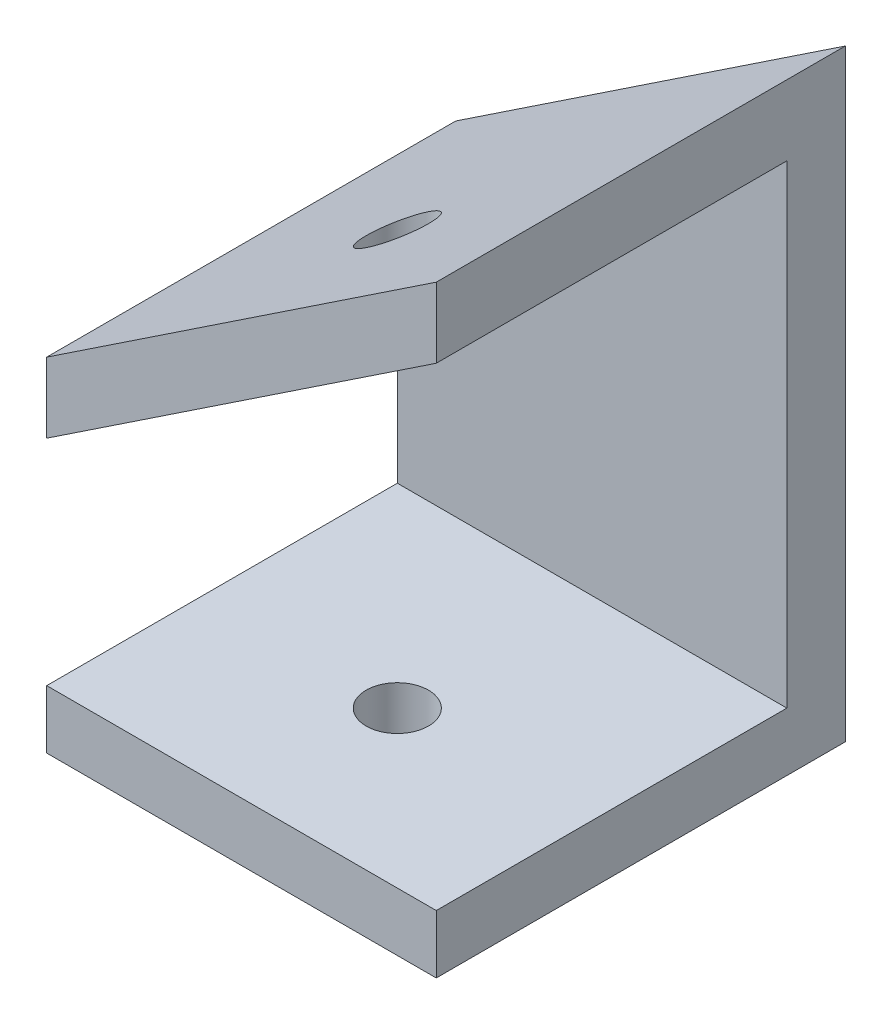
ISO-10303-21;
HEADER;
FILE_DESCRIPTION(('STEP AP214'),'2;1');
FILE_NAME('part.step','',(''),(''),'','','');
FILE_SCHEMA(('AUTOMOTIVE_DESIGN { 1 0 10303 214 1 1 1 1 }'));
ENDSEC;
DATA;
#1=APPLICATION_CONTEXT('core data for automotive mechanical design processes');
#2=APPLICATION_PROTOCOL_DEFINITION('international standard','automotive_design',2000,#1);
#3=PRODUCT_CONTEXT('',#1,'mechanical');
#4=PRODUCT('Part','Part','',(#3));
#5=PRODUCT_RELATED_PRODUCT_CATEGORY('part','',(#4));
#6=PRODUCT_DEFINITION_FORMATION('','',#4);
#7=PRODUCT_DEFINITION_CONTEXT('part definition',#1,'design');
#8=PRODUCT_DEFINITION('design','',#6,#7);
#9=PRODUCT_DEFINITION_SHAPE('','',#8);
#10=(LENGTH_UNIT() NAMED_UNIT(*) SI_UNIT(.MILLI.,.METRE.));
#11=(NAMED_UNIT(*) PLANE_ANGLE_UNIT() SI_UNIT($,.RADIAN.));
#12=(NAMED_UNIT(*) SI_UNIT($,.STERADIAN.) SOLID_ANGLE_UNIT());
#13=UNCERTAINTY_MEASURE_WITH_UNIT(LENGTH_MEASURE(1.E-05),#10,'distance_accuracy_value','');
#14=(GEOMETRIC_REPRESENTATION_CONTEXT(3) GLOBAL_UNCERTAINTY_ASSIGNED_CONTEXT((#13)) GLOBAL_UNIT_ASSIGNED_CONTEXT((#10,
#11,#12)) REPRESENTATION_CONTEXT('',''));
#15=CARTESIAN_POINT('',(0.,0.,0.));
#16=DIRECTION('',(0.,0.,1.));
#17=DIRECTION('',(1.,0.,0.));
#18=AXIS2_PLACEMENT_3D('',#15,#16,#17);
#19=CARTESIAN_POINT('',(12.3656729594458,-5.90614159277213,3.));
#20=DIRECTION('',(0.,1.,0.));
#21=DIRECTION('',(-1.,0.,0.));
#22=AXIS2_PLACEMENT_3D('',#19,#20,#21);
#23=PLANE('',#22);
#24=CARTESIAN_POINT('',(2.36567295944577,-5.90614159277213,13.));
#25=DIRECTION('',(0.,-1.,0.));
#26=DIRECTION('',(1.,0.,0.));
#27=AXIS2_PLACEMENT_3D('',#24,#25,#26);
#28=CIRCLE('',#27,1.6);
#29=CARTESIAN_POINT('',(3.96567295944577,-5.90614159277213,13.));
#30=VERTEX_POINT('',#29);
#31=EDGE_CURVE('E152',#30,#30,#28,.T.);
#32=ORIENTED_EDGE('',*,*,#31,.F.);
#33=EDGE_LOOP('',(#32));
#34=FACE_BOUND('',#33,.T.);
#35=DIRECTION('',(1.,0.,0.));
#36=VECTOR('',#35,1.);
#37=CARTESIAN_POINT('',(12.3656729594458,-5.90614159277213,0.));
#38=LINE('',#37,#36);
#39=CARTESIAN_POINT('',(-7.63432704055423,-5.90614159277213,0.));
#40=VERTEX_POINT('',#39);
#41=CARTESIAN_POINT('',(12.3656729594458,-5.90614159277213,0.));
#42=VERTEX_POINT('',#41);
#43=EDGE_CURVE('E71',#40,#42,#38,.T.);
#44=ORIENTED_EDGE('',*,*,#43,.T.);
#45=DIRECTION('',(0.,0.,-1.));
#46=VECTOR('',#45,1.);
#47=CARTESIAN_POINT('',(12.3656729594458,-5.90614159277213,3.));
#48=LINE('',#47,#46);
#49=CARTESIAN_POINT('',(12.3656729594458,-5.90614159277213,21.));
#50=VERTEX_POINT('',#49);
#51=EDGE_CURVE('E45',#50,#42,#48,.T.);
#52=ORIENTED_EDGE('',*,*,#51,.F.);
#53=DIRECTION('',(1.,0.,0.));
#54=VECTOR('',#53,1.);
#55=CARTESIAN_POINT('',(12.3656729594458,-5.90614159277213,21.));
#56=LINE('',#55,#54);
#57=CARTESIAN_POINT('',(-7.63432704055423,-5.90614159277213,21.));
#58=VERTEX_POINT('',#57);
#59=EDGE_CURVE('E132',#58,#50,#56,.T.);
#60=ORIENTED_EDGE('',*,*,#59,.F.);
#61=DIRECTION('',(0.,0.,-1.));
#62=VECTOR('',#61,1.);
#63=CARTESIAN_POINT('',(-7.63432704055423,-5.90614159277213,3.));
#64=LINE('',#63,#62);
#65=EDGE_CURVE('E11',#58,#40,#64,.T.);
#66=ORIENTED_EDGE('',*,*,#65,.T.);
#67=EDGE_LOOP('',(#44,#52,#60,#66));
#68=FACE_BOUND('',#67,.T.);
#69=ADVANCED_FACE('F37',(#34,#68),#23,.F.);
#70=CARTESIAN_POINT('',(12.3656729594458,21.4271917405612,3.));
#71=DIRECTION('',(-1.,0.,0.));
#72=DIRECTION('',(0.,-1.,0.));
#73=AXIS2_PLACEMENT_3D('',#70,#71,#72);
#74=PLANE('',#73);
#75=DIRECTION('',(0.,1.,0.));
#76=VECTOR('',#75,1.);
#77=CARTESIAN_POINT('',(12.3656729594458,21.4271917405612,3.));
#78=LINE('',#77,#76);
#79=CARTESIAN_POINT('',(12.3656729594458,-2.90614159277213,3.));
#80=VERTEX_POINT('',#79);
#81=CARTESIAN_POINT('',(12.3656729594458,21.4271917405612,3.));
#82=VERTEX_POINT('',#81);
#83=EDGE_CURVE('E105',#80,#82,#78,.T.);
#84=ORIENTED_EDGE('',*,*,#83,.F.);
#85=DIRECTION('',(0.,0.,1.));
#86=VECTOR('',#85,1.);
#87=CARTESIAN_POINT('',(12.3656729594458,-2.90614159277213,0.));
#88=LINE('',#87,#86);
#89=CARTESIAN_POINT('',(12.3656729594458,-2.90614159277213,21.));
#90=VERTEX_POINT('',#89);
#91=EDGE_CURVE('E141',#80,#90,#88,.T.);
#92=ORIENTED_EDGE('',*,*,#91,.T.);
#93=DIRECTION('',(0.,1.,0.));
#94=VECTOR('',#93,1.);
#95=CARTESIAN_POINT('',(12.3656729594458,-2.90614159277213,21.));
#96=LINE('',#95,#94);
#97=EDGE_CURVE('E92',#50,#90,#96,.T.);
#98=ORIENTED_EDGE('',*,*,#97,.F.);
#99=ORIENTED_EDGE('',*,*,#51,.T.);
#100=DIRECTION('',(0.,1.,0.));
#101=VECTOR('',#100,1.);
#102=CARTESIAN_POINT('',(12.3656729594458,21.4271917405612,0.));
#103=LINE('',#102,#101);
#104=CARTESIAN_POINT('',(12.3656729594458,25.0327430160252,0.));
#105=VERTEX_POINT('',#104);
#106=EDGE_CURVE('E80',#42,#105,#103,.T.);
#107=ORIENTED_EDGE('',*,*,#106,.T.);
#108=DIRECTION('',(0.,0.,1.));
#109=VECTOR('',#108,1.);
#110=CARTESIAN_POINT('',(12.3656729594458,25.0327430160252,0.));
#111=LINE('',#110,#109);
#112=CARTESIAN_POINT('',(12.3656729594458,25.0327430160252,21.));
#113=VERTEX_POINT('',#112);
#114=EDGE_CURVE('E113',#105,#113,#111,.T.);
#115=ORIENTED_EDGE('',*,*,#114,.T.);
#116=DIRECTION('',(0.,1.,0.));
#117=VECTOR('',#116,1.);
#118=CARTESIAN_POINT('',(12.3656729594458,21.4271917405612,21.));
#119=LINE('',#118,#117);
#120=CARTESIAN_POINT('',(12.3656729594458,21.4271917405612,21.));
#121=VERTEX_POINT('',#120);
#122=EDGE_CURVE('E121',#121,#113,#119,.T.);
#123=ORIENTED_EDGE('',*,*,#122,.F.);
#124=DIRECTION('',(0.,0.,1.));
#125=VECTOR('',#124,1.);
#126=CARTESIAN_POINT('',(12.3656729594458,21.4271917405612,0.));
#127=LINE('',#126,#125);
#128=EDGE_CURVE('E110',#82,#121,#127,.T.);
#129=ORIENTED_EDGE('',*,*,#128,.F.);
#130=EDGE_LOOP('',(#84,#92,#98,#99,#107,#115,#123,#129));
#131=FACE_BOUND('',#130,.T.);
#132=ADVANCED_FACE('F86',(#131),#74,.F.);
#133=CARTESIAN_POINT('',(-7.63432704055423,-2.90614159277213,3.));
#134=DIRECTION('',(1.,0.,0.));
#135=DIRECTION('',(0.,0.,-1.));
#136=AXIS2_PLACEMENT_3D('',#133,#134,#135);
#137=PLANE('',#136);
#138=DIRECTION('',(0.,-1.,0.));
#139=VECTOR('',#138,1.);
#140=CARTESIAN_POINT('',(-7.63432704055423,-2.90614159277213,0.));
#141=LINE('',#140,#139);
#142=CARTESIAN_POINT('',(-7.63432704055423,11.6994096826919,0.));
#143=VERTEX_POINT('',#142);
#144=EDGE_CURVE('E100',#143,#40,#141,.T.);
#145=ORIENTED_EDGE('',*,*,#144,.T.);
#146=ORIENTED_EDGE('',*,*,#65,.F.);
#147=DIRECTION('',(0.,-1.,0.));
#148=VECTOR('',#147,1.);
#149=CARTESIAN_POINT('',(-7.63432704055423,-5.90614159277213,21.));
#150=LINE('',#149,#148);
#151=CARTESIAN_POINT('',(-7.63432704055423,-2.90614159277213,21.));
#152=VERTEX_POINT('',#151);
#153=EDGE_CURVE('E138',#152,#58,#150,.T.);
#154=ORIENTED_EDGE('',*,*,#153,.F.);
#155=DIRECTION('',(0.,0.,1.));
#156=VECTOR('',#155,1.);
#157=CARTESIAN_POINT('',(-7.63432704055423,-2.90614159277213,0.));
#158=LINE('',#157,#156);
#159=CARTESIAN_POINT('',(-7.63432704055423,-2.90614159277213,3.));
#160=VERTEX_POINT('',#159);
#161=EDGE_CURVE('E142',#160,#152,#158,.T.);
#162=ORIENTED_EDGE('',*,*,#161,.F.);
#163=DIRECTION('',(0.,-1.,0.));
#164=VECTOR('',#163,1.);
#165=CARTESIAN_POINT('',(-7.63432704055423,-2.90614159277213,3.));
#166=LINE('',#165,#164);
#167=CARTESIAN_POINT('',(-7.63432704055423,8.09385840722787,3.));
#168=VERTEX_POINT('',#167);
#169=EDGE_CURVE('E52',#168,#160,#166,.T.);
#170=ORIENTED_EDGE('',*,*,#169,.F.);
#171=DIRECTION('',(0.,0.,1.));
#172=VECTOR('',#171,1.);
#173=CARTESIAN_POINT('',(-7.63432704055423,8.09385840722787,0.));
#174=LINE('',#173,#172);
#175=CARTESIAN_POINT('',(-7.63432704055423,8.09385840722787,21.));
#176=VERTEX_POINT('',#175);
#177=EDGE_CURVE('E108',#168,#176,#174,.T.);
#178=ORIENTED_EDGE('',*,*,#177,.T.);
#179=DIRECTION('',(0.,-1.,0.));
#180=VECTOR('',#179,1.);
#181=CARTESIAN_POINT('',(-7.63432704055423,8.09385840722787,21.));
#182=LINE('',#181,#180);
#183=CARTESIAN_POINT('',(-7.63432704055423,11.6994096826919,21.));
#184=VERTEX_POINT('',#183);
#185=EDGE_CURVE('E127',#184,#176,#182,.T.);
#186=ORIENTED_EDGE('',*,*,#185,.F.);
#187=DIRECTION('',(0.,0.,1.));
#188=VECTOR('',#187,1.);
#189=CARTESIAN_POINT('',(-7.63432704055423,11.6994096826919,0.));
#190=LINE('',#189,#188);
#191=EDGE_CURVE('E81',#143,#184,#190,.T.);
#192=ORIENTED_EDGE('',*,*,#191,.F.);
#193=EDGE_LOOP('',(#145,#146,#154,#162,#170,#178,#186,#192));
#194=FACE_BOUND('',#193,.T.);
#195=ADVANCED_FACE('F172',(#194),#137,.F.);
#196=CARTESIAN_POINT('',(0.,0.,3.));
#197=DIRECTION('',(0.,0.,-1.));
#198=DIRECTION('',(-1.,0.,0.));
#199=AXIS2_PLACEMENT_3D('',#196,#197,#198);
#200=PLANE('',#199);
#201=ORIENTED_EDGE('',*,*,#169,.T.);
#202=DIRECTION('',(1.,0.,0.));
#203=VECTOR('',#202,1.);
#204=CARTESIAN_POINT('',(0.,-2.90614159277213,3.));
#205=LINE('',#204,#203);
#206=EDGE_CURVE('E130',#160,#80,#205,.T.);
#207=ORIENTED_EDGE('',*,*,#206,.T.);
#208=ORIENTED_EDGE('',*,*,#83,.T.);
#209=DIRECTION('',(-0.832050294337843,-0.554700196225229,0.));
#210=VECTOR('',#209,1.);
#211=CARTESIAN_POINT('',(-7.63432704055423,8.09385840722787,3.));
#212=LINE('',#211,#210);
#213=EDGE_CURVE('E94',#82,#168,#212,.T.);
#214=ORIENTED_EDGE('',*,*,#213,.T.);
#215=EDGE_LOOP('',(#201,#207,#208,#214));
#216=FACE_BOUND('',#215,.T.);
#217=ADVANCED_FACE('F203',(#216),#200,.F.);
#218=CARTESIAN_POINT('',(0.,0.,0.));
#219=DIRECTION('',(0.,0.,-1.));
#220=DIRECTION('',(-1.,0.,0.));
#221=AXIS2_PLACEMENT_3D('',#218,#219,#220);
#222=PLANE('',#221);
#223=DIRECTION('',(-0.832050294337844,-0.554700196225229,0.));
#224=VECTOR('',#223,1.);
#225=CARTESIAN_POINT('',(-7.63432704055423,11.6994096826919,0.));
#226=LINE('',#225,#224);
#227=EDGE_CURVE('E99',#105,#143,#226,.T.);
#228=ORIENTED_EDGE('',*,*,#227,.F.);
#229=ORIENTED_EDGE('',*,*,#106,.F.);
#230=ORIENTED_EDGE('',*,*,#43,.F.);
#231=ORIENTED_EDGE('',*,*,#144,.F.);
#232=EDGE_LOOP('',(#228,#229,#230,#231));
#233=FACE_BOUND('',#232,.T.);
#234=ADVANCED_FACE('F97',(#233),#222,.T.);
#235=CARTESIAN_POINT('',(-7.63432704055423,8.09385840722787,0.));
#236=DIRECTION('',(0.554700196225229,-0.832050294337844,0.));
#237=DIRECTION('',(0.832050294337844,0.554700196225229,0.));
#238=AXIS2_PLACEMENT_3D('',#235,#236,#237);
#239=PLANE('',#238);
#240=CARTESIAN_POINT('',(2.36567295944577,14.7605250738945,13.));
#241=DIRECTION('',(0.554700196225229,-0.832050294337844,0.));
#242=DIRECTION('',(-0.832050294337844,-0.554700196225229,0.));
#243=AXIS2_PLACEMENT_3D('',#240,#241,#242);
#244=ELLIPSE('',#243,1.92296068024746,1.6);
#245=CARTESIAN_POINT('',(0.765672959445768,13.6938584072279,13.));
#246=VERTEX_POINT('',#245);
#247=EDGE_CURVE('E145',#246,#246,#244,.T.);
#248=ORIENTED_EDGE('',*,*,#247,.F.);
#249=EDGE_LOOP('',(#248));
#250=FACE_BOUND('',#249,.T.);
#251=ORIENTED_EDGE('',*,*,#213,.F.);
#252=ORIENTED_EDGE('',*,*,#128,.T.);
#253=DIRECTION('',(0.832050294337843,0.554700196225229,0.));
#254=VECTOR('',#253,1.);
#255=CARTESIAN_POINT('',(-7.63432704055423,8.09385840722787,21.));
#256=LINE('',#255,#254);
#257=EDGE_CURVE('E124',#176,#121,#256,.T.);
#258=ORIENTED_EDGE('',*,*,#257,.F.);
#259=ORIENTED_EDGE('',*,*,#177,.F.);
#260=EDGE_LOOP('',(#251,#252,#258,#259));
#261=FACE_BOUND('',#260,.T.);
#262=ADVANCED_FACE('F202',(#250,#261),#239,.T.);
#263=CARTESIAN_POINT('',(-7.63432704055423,11.6994096826919,0.));
#264=DIRECTION('',(-0.554700196225229,0.832050294337844,0.));
#265=DIRECTION('',(-0.832050294337844,-0.554700196225229,0.));
#266=AXIS2_PLACEMENT_3D('',#263,#264,#265);
#267=PLANE('',#266);
#268=CARTESIAN_POINT('',(2.36567295944577,18.3660763493585,13.));
#269=DIRECTION('',(-0.554700196225229,0.832050294337844,0.));
#270=DIRECTION('',(-0.832050294337844,-0.554700196225229,0.));
#271=AXIS2_PLACEMENT_3D('',#268,#269,#270);
#272=ELLIPSE('',#271,1.92296068024746,1.6);
#273=CARTESIAN_POINT('',(0.765672959445768,17.2994096826919,13.));
#274=VERTEX_POINT('',#273);
#275=EDGE_CURVE('E149',#274,#274,#272,.T.);
#276=ORIENTED_EDGE('',*,*,#275,.F.);
#277=EDGE_LOOP('',(#276));
#278=FACE_BOUND('',#277,.T.);
#279=ORIENTED_EDGE('',*,*,#191,.T.);
#280=DIRECTION('',(-0.832050294337844,-0.554700196225229,0.));
#281=VECTOR('',#280,1.);
#282=CARTESIAN_POINT('',(-7.63432704055423,11.6994096826919,21.));
#283=LINE('',#282,#281);
#284=EDGE_CURVE('E118',#113,#184,#283,.T.);
#285=ORIENTED_EDGE('',*,*,#284,.F.);
#286=ORIENTED_EDGE('',*,*,#114,.F.);
#287=ORIENTED_EDGE('',*,*,#227,.T.);
#288=EDGE_LOOP('',(#279,#285,#286,#287));
#289=FACE_BOUND('',#288,.T.);
#290=ADVANCED_FACE('F194',(#278,#289),#267,.T.);
#291=CARTESIAN_POINT('',(0.,0.,21.));
#292=DIRECTION('',(0.,0.,-1.));
#293=DIRECTION('',(-1.,0.,0.));
#294=AXIS2_PLACEMENT_3D('',#291,#292,#293);
#295=PLANE('',#294);
#296=ORIENTED_EDGE('',*,*,#185,.T.);
#297=ORIENTED_EDGE('',*,*,#257,.T.);
#298=ORIENTED_EDGE('',*,*,#122,.T.);
#299=ORIENTED_EDGE('',*,*,#284,.T.);
#300=EDGE_LOOP('',(#296,#297,#298,#299));
#301=FACE_BOUND('',#300,.T.);
#302=ADVANCED_FACE('F165',(#301),#295,.F.);
#303=CARTESIAN_POINT('',(-7.63432704055423,-2.90614159277213,0.));
#304=DIRECTION('',(0.,1.,0.));
#305=DIRECTION('',(0.,0.,1.));
#306=AXIS2_PLACEMENT_3D('',#303,#304,#305);
#307=PLANE('',#306);
#308=CARTESIAN_POINT('',(2.36567295944577,-2.90614159277213,13.));
#309=DIRECTION('',(0.,1.,0.));
#310=DIRECTION('',(0.,0.,1.));
#311=AXIS2_PLACEMENT_3D('',#308,#309,#310);
#312=CIRCLE('',#311,1.6);
#313=CARTESIAN_POINT('',(2.36567295944577,-2.90614159277213,14.6));
#314=VERTEX_POINT('',#313);
#315=EDGE_CURVE('E40',#314,#314,#312,.T.);
#316=ORIENTED_EDGE('',*,*,#315,.F.);
#317=EDGE_LOOP('',(#316));
#318=FACE_BOUND('',#317,.T.);
#319=ORIENTED_EDGE('',*,*,#206,.F.);
#320=ORIENTED_EDGE('',*,*,#161,.T.);
#321=DIRECTION('',(-1.,0.,0.));
#322=VECTOR('',#321,1.);
#323=CARTESIAN_POINT('',(-7.63432704055423,-2.90614159277213,21.));
#324=LINE('',#323,#322);
#325=EDGE_CURVE('E135',#90,#152,#324,.T.);
#326=ORIENTED_EDGE('',*,*,#325,.F.);
#327=ORIENTED_EDGE('',*,*,#91,.F.);
#328=EDGE_LOOP('',(#319,#320,#326,#327));
#329=FACE_BOUND('',#328,.T.);
#330=ADVANCED_FACE('F161',(#318,#329),#307,.T.);
#331=CARTESIAN_POINT('',(0.,0.,21.));
#332=DIRECTION('',(0.,0.,-1.));
#333=DIRECTION('',(-1.,0.,0.));
#334=AXIS2_PLACEMENT_3D('',#331,#332,#333);
#335=PLANE('',#334);
#336=ORIENTED_EDGE('',*,*,#59,.T.);
#337=ORIENTED_EDGE('',*,*,#97,.T.);
#338=ORIENTED_EDGE('',*,*,#325,.T.);
#339=ORIENTED_EDGE('',*,*,#153,.T.);
#340=EDGE_LOOP('',(#336,#337,#338,#339));
#341=FACE_BOUND('',#340,.T.);
#342=ADVANCED_FACE('F164',(#341),#335,.F.);
#343=CARTESIAN_POINT('',(2.36567295944577,25.0327430160252,13.));
#344=DIRECTION('',(0.,-1.,0.));
#345=DIRECTION('',(1.,0.,0.));
#346=AXIS2_PLACEMENT_3D('',#343,#344,#345);
#347=CYLINDRICAL_SURFACE('',#346,1.6);
#348=ORIENTED_EDGE('',*,*,#315,.T.);
#349=EDGE_LOOP('',(#348));
#350=FACE_BOUND('',#349,.T.);
#351=ORIENTED_EDGE('',*,*,#31,.T.);
#352=EDGE_LOOP('',(#351));
#353=FACE_BOUND('',#352,.T.);
#354=ADVANCED_FACE('F159',(#350,#353),#347,.F.);
#355=ORIENTED_EDGE('',*,*,#247,.T.);
#356=EDGE_LOOP('',(#355));
#357=FACE_BOUND('',#356,.T.);
#358=ORIENTED_EDGE('',*,*,#275,.T.);
#359=EDGE_LOOP('',(#358));
#360=FACE_BOUND('',#359,.T.);
#361=ADVANCED_FACE('F297',(#357,#360),#347,.F.);
#362=CLOSED_SHELL('',(#69,#132,#195,#217,#234,#262,#290,#302,#330,#342,#354,#361));
#363=MANIFOLD_SOLID_BREP('B2',#362);
#364=ADVANCED_BREP_SHAPE_REPRESENTATION('',(#18,#363),#14);
#365=SHAPE_DEFINITION_REPRESENTATION(#9,#364);
ENDSEC;
END-ISO-10303-21;
